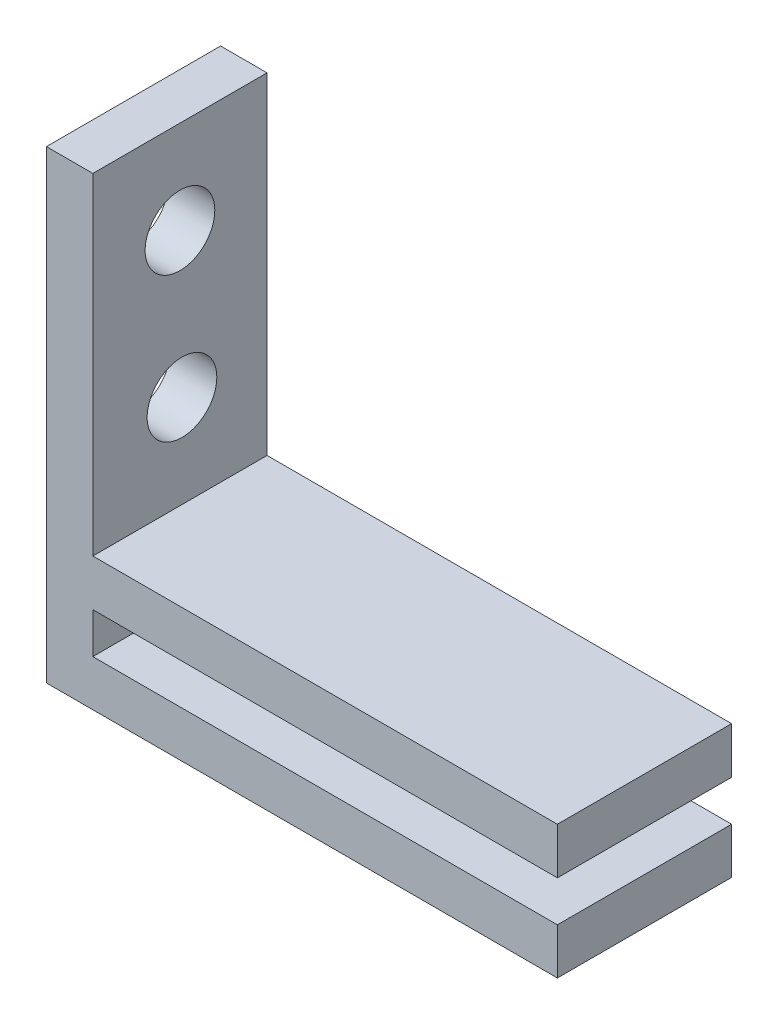
ISO-10303-21;
HEADER;
FILE_DESCRIPTION(('STEP AP214'),'2;1');
FILE_NAME('part.step','',(''),(''),'','','');
FILE_SCHEMA(('AUTOMOTIVE_DESIGN { 1 0 10303 214 1 1 1 1 }'));
ENDSEC;
DATA;
#1=APPLICATION_CONTEXT('core data for automotive mechanical design processes');
#2=APPLICATION_PROTOCOL_DEFINITION('international standard','automotive_design',2000,#1);
#3=PRODUCT_CONTEXT('',#1,'mechanical');
#4=PRODUCT('Part','Part','',(#3));
#5=PRODUCT_RELATED_PRODUCT_CATEGORY('part','',(#4));
#6=PRODUCT_DEFINITION_FORMATION('','',#4);
#7=PRODUCT_DEFINITION_CONTEXT('part definition',#1,'design');
#8=PRODUCT_DEFINITION('design','',#6,#7);
#9=PRODUCT_DEFINITION_SHAPE('','',#8);
#10=(LENGTH_UNIT() NAMED_UNIT(*) SI_UNIT(.MILLI.,.METRE.));
#11=(NAMED_UNIT(*) PLANE_ANGLE_UNIT() SI_UNIT($,.RADIAN.));
#12=(NAMED_UNIT(*) SI_UNIT($,.STERADIAN.) SOLID_ANGLE_UNIT());
#13=UNCERTAINTY_MEASURE_WITH_UNIT(LENGTH_MEASURE(1.E-05),#10,'distance_accuracy_value','');
#14=(GEOMETRIC_REPRESENTATION_CONTEXT(3) GLOBAL_UNCERTAINTY_ASSIGNED_CONTEXT((#13)) GLOBAL_UNIT_ASSIGNED_CONTEXT((#10,
#11,#12)) REPRESENTATION_CONTEXT('',''));
#15=CARTESIAN_POINT('',(0.,0.,0.));
#16=DIRECTION('',(0.,0.,1.));
#17=DIRECTION('',(1.,0.,0.));
#18=AXIS2_PLACEMENT_3D('',#15,#16,#17);
#19=CARTESIAN_POINT('',(2.,0.,0.));
#20=DIRECTION('',(1.,0.,0.));
#21=DIRECTION('',(0.,0.,-1.));
#22=AXIS2_PLACEMENT_3D('',#19,#20,#21);
#23=PLANE('',#22);
#24=DIRECTION('',(0.,1.,0.));
#25=VECTOR('',#24,1.);
#26=CARTESIAN_POINT('',(2.,9.02439024390244,-6.7595818815331));
#27=LINE('',#26,#25);
#28=CARTESIAN_POINT('',(2.,-8.99213043612717,-6.7595818815331));
#29=VERTEX_POINT('',#28);
#30=CARTESIAN_POINT('',(2.,-7.24213043612718,-6.7595818815331));
#31=VERTEX_POINT('',#30);
#32=EDGE_CURVE('E204',#29,#31,#27,.T.);
#33=ORIENTED_EDGE('',*,*,#32,.T.);
#34=DIRECTION('',(0.,0.,-1.));
#35=VECTOR('',#34,1.);
#36=CARTESIAN_POINT('',(2.,-7.24213043612717,0.));
#37=LINE('',#36,#35);
#38=CARTESIAN_POINT('',(2.,-7.24213043612718,0.740418118466897));
#39=VERTEX_POINT('',#38);
#40=EDGE_CURVE('E62',#39,#31,#37,.T.);
#41=ORIENTED_EDGE('',*,*,#40,.F.);
#42=DIRECTION('',(0.,-1.,0.));
#43=VECTOR('',#42,1.);
#44=CARTESIAN_POINT('',(2.,9.02439024390244,0.740418118466899));
#45=LINE('',#44,#43);
#46=CARTESIAN_POINT('',(2.,-8.99213043612717,0.740418118466897));
#47=VERTEX_POINT('',#46);
#48=EDGE_CURVE('E203',#39,#47,#45,.T.);
#49=ORIENTED_EDGE('',*,*,#48,.T.);
#50=DIRECTION('',(0.,0.,1.));
#51=VECTOR('',#50,1.);
#52=CARTESIAN_POINT('',(2.,-8.99213043612717,-6.7595818815331));
#53=LINE('',#52,#51);
#54=EDGE_CURVE('E134',#29,#47,#53,.T.);
#55=ORIENTED_EDGE('',*,*,#54,.F.);
#56=EDGE_LOOP('',(#33,#41,#49,#55));
#57=FACE_BOUND('',#56,.T.);
#58=ADVANCED_FACE('F44',(#57),#23,.T.);
#59=CARTESIAN_POINT('',(2.,9.02439024390244,0.740418118466899));
#60=DIRECTION('',(0.,0.,-1.));
#61=DIRECTION('',(0.,1.,0.));
#62=AXIS2_PLACEMENT_3D('',#59,#60,#61);
#63=PLANE('',#62);
#64=DIRECTION('',(0.,-1.,0.));
#65=VECTOR('',#64,1.);
#66=CARTESIAN_POINT('',(0.,9.02439024390244,0.740418118466899));
#67=LINE('',#66,#65);
#68=CARTESIAN_POINT('',(0.,9.02439024390244,0.740418118466899));
#69=VERTEX_POINT('',#68);
#70=CARTESIAN_POINT('',(0.,-10.9756097560976,0.740418118466897));
#71=VERTEX_POINT('',#70);
#72=EDGE_CURVE('E199',#69,#71,#67,.T.);
#73=ORIENTED_EDGE('',*,*,#72,.T.);
#74=DIRECTION('',(-1.,0.,0.));
#75=VECTOR('',#74,1.);
#76=CARTESIAN_POINT('',(2.,-10.9756097560976,0.740418118466897));
#77=LINE('',#76,#75);
#78=CARTESIAN_POINT('',(22.,-10.9756097560976,0.740418118466897));
#79=VERTEX_POINT('',#78);
#80=EDGE_CURVE('E11',#79,#71,#77,.T.);
#81=ORIENTED_EDGE('',*,*,#80,.F.);
#82=DIRECTION('',(0.,-1.,0.));
#83=VECTOR('',#82,1.);
#84=CARTESIAN_POINT('',(22.,-10.9756097560976,0.740418118466897));
#85=LINE('',#84,#83);
#86=CARTESIAN_POINT('',(22.,-8.99213043612717,0.740418118466897));
#87=VERTEX_POINT('',#86);
#88=EDGE_CURVE('E180',#87,#79,#85,.T.);
#89=ORIENTED_EDGE('',*,*,#88,.F.);
#90=DIRECTION('',(-1.,0.,0.));
#91=VECTOR('',#90,1.);
#92=CARTESIAN_POINT('',(22.,-8.99213043612717,0.740418118466897));
#93=LINE('',#92,#91);
#94=EDGE_CURVE('E188',#87,#47,#93,.T.);
#95=ORIENTED_EDGE('',*,*,#94,.T.);
#96=ORIENTED_EDGE('',*,*,#48,.F.);
#97=DIRECTION('',(-1.,0.,0.));
#98=VECTOR('',#97,1.);
#99=CARTESIAN_POINT('',(22.,-7.24213043612717,0.740418118466897));
#100=LINE('',#99,#98);
#101=CARTESIAN_POINT('',(22.,-7.24213043612717,0.740418118466897));
#102=VERTEX_POINT('',#101);
#103=EDGE_CURVE('E135',#102,#39,#100,.T.);
#104=ORIENTED_EDGE('',*,*,#103,.F.);
#105=DIRECTION('',(0.,-1.,0.));
#106=VECTOR('',#105,1.);
#107=CARTESIAN_POINT('',(22.,0.,0.740418118466898));
#108=LINE('',#107,#106);
#109=CARTESIAN_POINT('',(22.,-5.24213043612717,0.740418118466897));
#110=VERTEX_POINT('',#109);
#111=EDGE_CURVE('E138',#110,#102,#108,.T.);
#112=ORIENTED_EDGE('',*,*,#111,.F.);
#113=DIRECTION('',(-1.,0.,0.));
#114=VECTOR('',#113,1.);
#115=CARTESIAN_POINT('',(22.,-5.24213043612717,0.740418118466897));
#116=LINE('',#115,#114);
#117=CARTESIAN_POINT('',(2.,-5.24213043612717,0.740418118466897));
#118=VERTEX_POINT('',#117);
#119=EDGE_CURVE('E125',#110,#118,#116,.T.);
#120=ORIENTED_EDGE('',*,*,#119,.T.);
#121=CARTESIAN_POINT('',(2.,9.02439024390244,0.740418118466899));
#122=VERTEX_POINT('',#121);
#123=EDGE_CURVE('E70',#122,#118,#45,.T.);
#124=ORIENTED_EDGE('',*,*,#123,.F.);
#125=DIRECTION('',(-1.,0.,0.));
#126=VECTOR('',#125,1.);
#127=CARTESIAN_POINT('',(2.,9.02439024390244,0.740418118466899));
#128=LINE('',#127,#126);
#129=EDGE_CURVE('E210',#122,#69,#128,.T.);
#130=ORIENTED_EDGE('',*,*,#129,.T.);
#131=EDGE_LOOP('',(#73,#81,#89,#95,#96,#104,#112,#120,#124,#130));
#132=FACE_BOUND('',#131,.T.);
#133=ADVANCED_FACE('F46',(#132),#63,.F.);
#134=CARTESIAN_POINT('',(2.,-10.9756097560976,0.740418118466897));
#135=DIRECTION('',(0.,1.,0.));
#136=DIRECTION('',(0.,0.,1.));
#137=AXIS2_PLACEMENT_3D('',#134,#135,#136);
#138=PLANE('',#137);
#139=DIRECTION('',(0.,0.,-1.));
#140=VECTOR('',#139,1.);
#141=CARTESIAN_POINT('',(0.,-10.9756097560976,0.740418118466897));
#142=LINE('',#141,#140);
#143=CARTESIAN_POINT('',(0.,-10.9756097560976,-6.7595818815331));
#144=VERTEX_POINT('',#143);
#145=EDGE_CURVE('E213',#71,#144,#142,.T.);
#146=ORIENTED_EDGE('',*,*,#145,.T.);
#147=DIRECTION('',(-1.,0.,0.));
#148=VECTOR('',#147,1.);
#149=CARTESIAN_POINT('',(2.,-10.9756097560976,-6.7595818815331));
#150=LINE('',#149,#148);
#151=CARTESIAN_POINT('',(22.,-10.9756097560976,-6.7595818815331));
#152=VERTEX_POINT('',#151);
#153=EDGE_CURVE('E54',#152,#144,#150,.T.);
#154=ORIENTED_EDGE('',*,*,#153,.F.);
#155=DIRECTION('',(0.,0.,-1.));
#156=VECTOR('',#155,1.);
#157=CARTESIAN_POINT('',(22.,-10.9756097560976,-6.7595818815331));
#158=LINE('',#157,#156);
#159=EDGE_CURVE('E184',#79,#152,#158,.T.);
#160=ORIENTED_EDGE('',*,*,#159,.F.);
#161=ORIENTED_EDGE('',*,*,#80,.T.);
#162=EDGE_LOOP('',(#146,#154,#160,#161));
#163=FACE_BOUND('',#162,.T.);
#164=ADVANCED_FACE('F273',(#163),#138,.F.);
#165=CARTESIAN_POINT('',(2.,9.02439024390244,-6.7595818815331));
#166=DIRECTION('',(0.,0.,1.));
#167=DIRECTION('',(1.,0.,0.));
#168=AXIS2_PLACEMENT_3D('',#165,#166,#167);
#169=PLANE('',#168);
#170=DIRECTION('',(0.,1.,0.));
#171=VECTOR('',#170,1.);
#172=CARTESIAN_POINT('',(0.,9.02439024390244,-6.7595818815331));
#173=LINE('',#172,#171);
#174=CARTESIAN_POINT('',(0.,9.02439024390244,-6.7595818815331));
#175=VERTEX_POINT('',#174);
#176=EDGE_CURVE('E216',#144,#175,#173,.T.);
#177=ORIENTED_EDGE('',*,*,#176,.T.);
#178=DIRECTION('',(-1.,0.,0.));
#179=VECTOR('',#178,1.);
#180=CARTESIAN_POINT('',(2.,9.02439024390244,-6.7595818815331));
#181=LINE('',#180,#179);
#182=CARTESIAN_POINT('',(2.,9.02439024390244,-6.7595818815331));
#183=VERTEX_POINT('',#182);
#184=EDGE_CURVE('E225',#183,#175,#181,.T.);
#185=ORIENTED_EDGE('',*,*,#184,.F.);
#186=CARTESIAN_POINT('',(2.,-5.24213043612717,-6.7595818815331));
#187=VERTEX_POINT('',#186);
#188=EDGE_CURVE('E202',#187,#183,#27,.T.);
#189=ORIENTED_EDGE('',*,*,#188,.F.);
#190=DIRECTION('',(-1.,0.,0.));
#191=VECTOR('',#190,1.);
#192=CARTESIAN_POINT('',(22.,-5.24213043612717,-6.7595818815331));
#193=LINE('',#192,#191);
#194=CARTESIAN_POINT('',(22.,-5.24213043612717,-6.7595818815331));
#195=VERTEX_POINT('',#194);
#196=EDGE_CURVE('E162',#195,#187,#193,.T.);
#197=ORIENTED_EDGE('',*,*,#196,.F.);
#198=DIRECTION('',(0.,1.,0.));
#199=VECTOR('',#198,1.);
#200=CARTESIAN_POINT('',(22.,0.,-6.7595818815331));
#201=LINE('',#200,#199);
#202=CARTESIAN_POINT('',(22.,-7.24213043612717,-6.7595818815331));
#203=VERTEX_POINT('',#202);
#204=EDGE_CURVE('E148',#203,#195,#201,.T.);
#205=ORIENTED_EDGE('',*,*,#204,.F.);
#206=DIRECTION('',(-1.,0.,0.));
#207=VECTOR('',#206,1.);
#208=CARTESIAN_POINT('',(22.,-7.24213043612717,-6.7595818815331));
#209=LINE('',#208,#207);
#210=EDGE_CURVE('E167',#203,#31,#209,.T.);
#211=ORIENTED_EDGE('',*,*,#210,.T.);
#212=ORIENTED_EDGE('',*,*,#32,.F.);
#213=DIRECTION('',(-1.,0.,0.));
#214=VECTOR('',#213,1.);
#215=CARTESIAN_POINT('',(22.,-8.99213043612717,-6.7595818815331));
#216=LINE('',#215,#214);
#217=CARTESIAN_POINT('',(22.,-8.99213043612717,-6.7595818815331));
#218=VERTEX_POINT('',#217);
#219=EDGE_CURVE('E195',#218,#29,#216,.T.);
#220=ORIENTED_EDGE('',*,*,#219,.F.);
#221=DIRECTION('',(0.,1.,0.));
#222=VECTOR('',#221,1.);
#223=CARTESIAN_POINT('',(22.,-10.9756097560976,-6.7595818815331));
#224=LINE('',#223,#222);
#225=EDGE_CURVE('E173',#152,#218,#224,.T.);
#226=ORIENTED_EDGE('',*,*,#225,.F.);
#227=ORIENTED_EDGE('',*,*,#153,.T.);
#228=EDGE_LOOP('',(#177,#185,#189,#197,#205,#211,#212,#220,#226,#227));
#229=FACE_BOUND('',#228,.T.);
#230=ADVANCED_FACE('F258',(#229),#169,.F.);
#231=CARTESIAN_POINT('',(2.,9.02439024390244,0.740418118466899));
#232=DIRECTION('',(0.,-1.,0.));
#233=DIRECTION('',(0.,0.,-1.));
#234=AXIS2_PLACEMENT_3D('',#231,#232,#233);
#235=PLANE('',#234);
#236=DIRECTION('',(0.,0.,1.));
#237=VECTOR('',#236,1.);
#238=CARTESIAN_POINT('',(0.,9.02439024390244,0.740418118466899));
#239=LINE('',#238,#237);
#240=EDGE_CURVE('E219',#175,#69,#239,.T.);
#241=ORIENTED_EDGE('',*,*,#240,.T.);
#242=ORIENTED_EDGE('',*,*,#129,.F.);
#243=DIRECTION('',(0.,0.,1.));
#244=VECTOR('',#243,1.);
#245=CARTESIAN_POINT('',(2.,9.02439024390244,0.740418118466899));
#246=LINE('',#245,#244);
#247=EDGE_CURVE('E207',#183,#122,#246,.T.);
#248=ORIENTED_EDGE('',*,*,#247,.F.);
#249=ORIENTED_EDGE('',*,*,#184,.T.);
#250=EDGE_LOOP('',(#241,#242,#248,#249));
#251=FACE_BOUND('',#250,.T.);
#252=ADVANCED_FACE('F253',(#251),#235,.F.);
#253=CARTESIAN_POINT('',(2.,5.02439024390244,-3.0095818815331));
#254=DIRECTION('',(1.,0.,0.));
#255=DIRECTION('',(0.,0.,-1.));
#256=AXIS2_PLACEMENT_3D('',#253,#254,#255);
#257=CIRCLE('',#256,1.5);
#258=CARTESIAN_POINT('',(2.,5.02439024390244,-4.5095818815331));
#259=VERTEX_POINT('',#258);
#260=EDGE_CURVE('E234',#259,#259,#257,.T.);
#261=ORIENTED_EDGE('',*,*,#260,.F.);
#262=EDGE_LOOP('',(#261));
#263=FACE_BOUND('',#262,.T.);
#264=CARTESIAN_POINT('',(2.,-1.24213043612717,-3.09645831879379));
#265=DIRECTION('',(1.,0.,0.));
#266=DIRECTION('',(0.,0.,-1.));
#267=AXIS2_PLACEMENT_3D('',#264,#265,#266);
#268=CIRCLE('',#267,1.5);
#269=CARTESIAN_POINT('',(2.,-1.24213043612717,-4.59645831879379));
#270=VERTEX_POINT('',#269);
#271=EDGE_CURVE('E155',#270,#270,#268,.T.);
#272=ORIENTED_EDGE('',*,*,#271,.F.);
#273=EDGE_LOOP('',(#272));
#274=FACE_BOUND('',#273,.T.);
#275=DIRECTION('',(0.,0.,-1.));
#276=VECTOR('',#275,1.);
#277=CARTESIAN_POINT('',(2.,-5.24213043612717,0.));
#278=LINE('',#277,#276);
#279=EDGE_CURVE('E131',#118,#187,#278,.T.);
#280=ORIENTED_EDGE('',*,*,#279,.T.);
#281=ORIENTED_EDGE('',*,*,#188,.T.);
#282=ORIENTED_EDGE('',*,*,#247,.T.);
#283=ORIENTED_EDGE('',*,*,#123,.T.);
#284=EDGE_LOOP('',(#280,#281,#282,#283));
#285=FACE_BOUND('',#284,.T.);
#286=ADVANCED_FACE('F250',(#263,#274,#285),#23,.T.);
#287=CARTESIAN_POINT('',(0.,0.,0.));
#288=DIRECTION('',(1.,0.,0.));
#289=DIRECTION('',(0.,0.,-1.));
#290=AXIS2_PLACEMENT_3D('',#287,#288,#289);
#291=PLANE('',#290);
#292=CARTESIAN_POINT('',(0.,5.02439024390244,-3.0095818815331));
#293=DIRECTION('',(1.,0.,0.));
#294=DIRECTION('',(0.,0.,-1.));
#295=AXIS2_PLACEMENT_3D('',#292,#293,#294);
#296=CIRCLE('',#295,1.5);
#297=CARTESIAN_POINT('',(0.,5.02439024390244,-4.5095818815331));
#298=VERTEX_POINT('',#297);
#299=EDGE_CURVE('E48',#298,#298,#296,.T.);
#300=ORIENTED_EDGE('',*,*,#299,.T.);
#301=EDGE_LOOP('',(#300));
#302=FACE_BOUND('',#301,.T.);
#303=CARTESIAN_POINT('',(0.,-1.24213043612717,-3.09645831879379));
#304=DIRECTION('',(1.,0.,0.));
#305=DIRECTION('',(0.,0.,-1.));
#306=AXIS2_PLACEMENT_3D('',#303,#304,#305);
#307=CIRCLE('',#306,1.5);
#308=CARTESIAN_POINT('',(0.,-1.24213043612717,-4.59645831879379));
#309=VERTEX_POINT('',#308);
#310=EDGE_CURVE('E231',#309,#309,#307,.T.);
#311=ORIENTED_EDGE('',*,*,#310,.T.);
#312=EDGE_LOOP('',(#311));
#313=FACE_BOUND('',#312,.T.);
#314=ORIENTED_EDGE('',*,*,#72,.F.);
#315=ORIENTED_EDGE('',*,*,#240,.F.);
#316=ORIENTED_EDGE('',*,*,#176,.F.);
#317=ORIENTED_EDGE('',*,*,#145,.F.);
#318=EDGE_LOOP('',(#314,#315,#316,#317));
#319=FACE_BOUND('',#318,.T.);
#320=ADVANCED_FACE('F252',(#302,#313,#319),#291,.F.);
#321=CARTESIAN_POINT('',(22.,-8.99213043612717,-6.7595818815331));
#322=DIRECTION('',(0.,-1.,0.));
#323=DIRECTION('',(0.,0.,-1.));
#324=AXIS2_PLACEMENT_3D('',#321,#322,#323);
#325=PLANE('',#324);
#326=ORIENTED_EDGE('',*,*,#54,.T.);
#327=ORIENTED_EDGE('',*,*,#94,.F.);
#328=DIRECTION('',(0.,0.,1.));
#329=VECTOR('',#328,1.);
#330=CARTESIAN_POINT('',(22.,-8.99213043612717,-6.7595818815331));
#331=LINE('',#330,#329);
#332=EDGE_CURVE('E177',#218,#87,#331,.T.);
#333=ORIENTED_EDGE('',*,*,#332,.F.);
#334=ORIENTED_EDGE('',*,*,#219,.T.);
#335=EDGE_LOOP('',(#326,#327,#333,#334));
#336=FACE_BOUND('',#335,.T.);
#337=ADVANCED_FACE('F265',(#336),#325,.F.);
#338=CARTESIAN_POINT('',(22.,0.,0.));
#339=DIRECTION('',(1.,0.,0.));
#340=DIRECTION('',(0.,0.,-1.));
#341=AXIS2_PLACEMENT_3D('',#338,#339,#340);
#342=PLANE('',#341);
#343=ORIENTED_EDGE('',*,*,#225,.T.);
#344=ORIENTED_EDGE('',*,*,#332,.T.);
#345=ORIENTED_EDGE('',*,*,#88,.T.);
#346=ORIENTED_EDGE('',*,*,#159,.T.);
#347=EDGE_LOOP('',(#343,#344,#345,#346));
#348=FACE_BOUND('',#347,.T.);
#349=ADVANCED_FACE('F270',(#348),#342,.T.);
#350=CARTESIAN_POINT('',(22.,-5.24213043612717,0.));
#351=DIRECTION('',(0.,1.,0.));
#352=DIRECTION('',(0.,0.,1.));
#353=AXIS2_PLACEMENT_3D('',#350,#351,#352);
#354=PLANE('',#353);
#355=ORIENTED_EDGE('',*,*,#279,.F.);
#356=ORIENTED_EDGE('',*,*,#119,.F.);
#357=DIRECTION('',(0.,0.,-1.));
#358=VECTOR('',#357,1.);
#359=CARTESIAN_POINT('',(22.,-5.24213043612717,0.));
#360=LINE('',#359,#358);
#361=EDGE_CURVE('E130',#110,#195,#360,.T.);
#362=ORIENTED_EDGE('',*,*,#361,.T.);
#363=ORIENTED_EDGE('',*,*,#196,.T.);
#364=EDGE_LOOP('',(#355,#356,#362,#363));
#365=FACE_BOUND('',#364,.T.);
#366=ADVANCED_FACE('F127',(#365),#354,.T.);
#367=CARTESIAN_POINT('',(22.,-7.24213043612717,0.));
#368=DIRECTION('',(0.,1.,0.));
#369=DIRECTION('',(0.,0.,1.));
#370=AXIS2_PLACEMENT_3D('',#367,#368,#369);
#371=PLANE('',#370);
#372=ORIENTED_EDGE('',*,*,#40,.T.);
#373=ORIENTED_EDGE('',*,*,#210,.F.);
#374=DIRECTION('',(0.,0.,-1.));
#375=VECTOR('',#374,1.);
#376=CARTESIAN_POINT('',(22.,-7.24213043612717,0.));
#377=LINE('',#376,#375);
#378=EDGE_CURVE('E144',#102,#203,#377,.T.);
#379=ORIENTED_EDGE('',*,*,#378,.F.);
#380=ORIENTED_EDGE('',*,*,#103,.T.);
#381=EDGE_LOOP('',(#372,#373,#379,#380));
#382=FACE_BOUND('',#381,.T.);
#383=ADVANCED_FACE('F310',(#382),#371,.F.);
#384=CARTESIAN_POINT('',(22.,0.,0.));
#385=DIRECTION('',(1.,0.,0.));
#386=DIRECTION('',(0.,0.,-1.));
#387=AXIS2_PLACEMENT_3D('',#384,#385,#386);
#388=PLANE('',#387);
#389=ORIENTED_EDGE('',*,*,#361,.F.);
#390=ORIENTED_EDGE('',*,*,#111,.T.);
#391=ORIENTED_EDGE('',*,*,#378,.T.);
#392=ORIENTED_EDGE('',*,*,#204,.T.);
#393=EDGE_LOOP('',(#389,#390,#391,#392));
#394=FACE_BOUND('',#393,.T.);
#395=ADVANCED_FACE('F146',(#394),#388,.T.);
#396=CARTESIAN_POINT('',(-18.,-1.24213043612717,-3.09645831879379));
#397=DIRECTION('',(1.,0.,0.));
#398=DIRECTION('',(0.,0.,-1.));
#399=AXIS2_PLACEMENT_3D('',#396,#397,#398);
#400=CYLINDRICAL_SURFACE('',#399,1.5);
#401=ORIENTED_EDGE('',*,*,#271,.T.);
#402=EDGE_LOOP('',(#401));
#403=FACE_BOUND('',#402,.T.);
#404=ORIENTED_EDGE('',*,*,#310,.F.);
#405=EDGE_LOOP('',(#404));
#406=FACE_BOUND('',#405,.T.);
#407=ADVANCED_FACE('F247',(#403,#406),#400,.F.);
#408=CARTESIAN_POINT('',(-18.,5.02439024390244,-3.0095818815331));
#409=DIRECTION('',(1.,0.,0.));
#410=DIRECTION('',(0.,0.,-1.));
#411=AXIS2_PLACEMENT_3D('',#408,#409,#410);
#412=CYLINDRICAL_SURFACE('',#411,1.5);
#413=ORIENTED_EDGE('',*,*,#260,.T.);
#414=EDGE_LOOP('',(#413));
#415=FACE_BOUND('',#414,.T.);
#416=ORIENTED_EDGE('',*,*,#299,.F.);
#417=EDGE_LOOP('',(#416));
#418=FACE_BOUND('',#417,.T.);
#419=ADVANCED_FACE('F300',(#415,#418),#412,.F.);
#420=CLOSED_SHELL('',(#58,#133,#164,#230,#252,#286,#320,#337,#349,#366,#383,#395,#407,#419));
#421=MANIFOLD_SOLID_BREP('B2',#420);
#422=ADVANCED_BREP_SHAPE_REPRESENTATION('',(#18,#421),#14);
#423=SHAPE_DEFINITION_REPRESENTATION(#9,#422);
ENDSEC;
END-ISO-10303-21;
